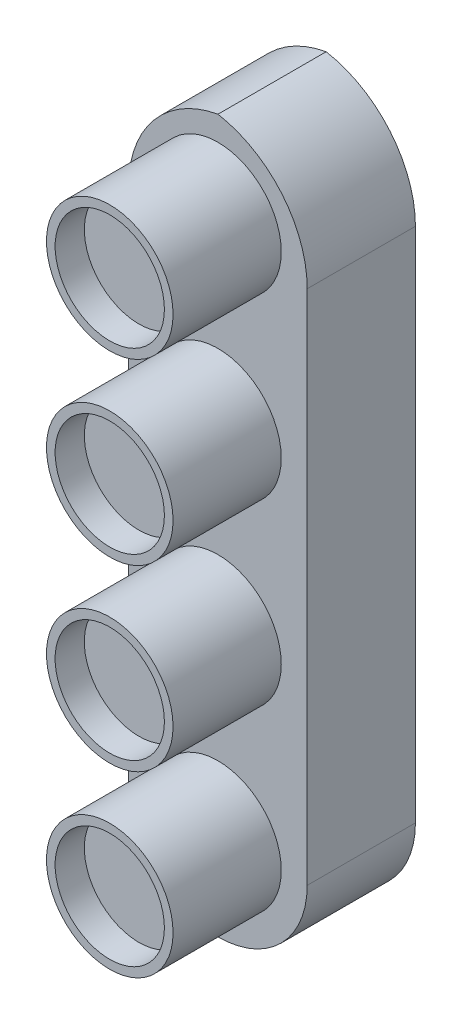
ISO-10303-21;
HEADER;
FILE_DESCRIPTION(('STEP AP214'),'2;1');
FILE_NAME('part.step','',(''),(''),'','','');
FILE_SCHEMA(('AUTOMOTIVE_DESIGN { 1 0 10303 214 1 1 1 1 }'));
ENDSEC;
DATA;
#1=APPLICATION_CONTEXT('core data for automotive mechanical design processes');
#2=APPLICATION_PROTOCOL_DEFINITION('international standard','automotive_design',2000,#1);
#3=PRODUCT_CONTEXT('',#1,'mechanical');
#4=PRODUCT('Part','Part','',(#3));
#5=PRODUCT_RELATED_PRODUCT_CATEGORY('part','',(#4));
#6=PRODUCT_DEFINITION_FORMATION('','',#4);
#7=PRODUCT_DEFINITION_CONTEXT('part definition',#1,'design');
#8=PRODUCT_DEFINITION('design','',#6,#7);
#9=PRODUCT_DEFINITION_SHAPE('','',#8);
#10=(LENGTH_UNIT() NAMED_UNIT(*) SI_UNIT(.MILLI.,.METRE.));
#11=(NAMED_UNIT(*) PLANE_ANGLE_UNIT() SI_UNIT($,.RADIAN.));
#12=(NAMED_UNIT(*) SI_UNIT($,.STERADIAN.) SOLID_ANGLE_UNIT());
#13=UNCERTAINTY_MEASURE_WITH_UNIT(LENGTH_MEASURE(1.E-05),#10,'distance_accuracy_value','');
#14=(GEOMETRIC_REPRESENTATION_CONTEXT(3) GLOBAL_UNCERTAINTY_ASSIGNED_CONTEXT((#13)) GLOBAL_UNIT_ASSIGNED_CONTEXT((#10,
#11,#12)) REPRESENTATION_CONTEXT('',''));
#15=CARTESIAN_POINT('',(0.,0.,0.));
#16=DIRECTION('',(0.,0.,1.));
#17=DIRECTION('',(1.,0.,0.));
#18=AXIS2_PLACEMENT_3D('',#15,#16,#17);
#19=CARTESIAN_POINT('',(-129.08402278584,165.,20.));
#20=DIRECTION('',(1.,0.,0.));
#21=DIRECTION('',(0.,1.,0.));
#22=AXIS2_PLACEMENT_3D('',#19,#20,#21);
#23=PLANE('',#22);
#24=DIRECTION('',(0.,-1.,0.));
#25=VECTOR('',#24,1.);
#26=CARTESIAN_POINT('',(-129.08402278584,165.,0.));
#27=LINE('',#26,#25);
#28=CARTESIAN_POINT('',(-129.08402278584,155.,0.));
#29=VERTEX_POINT('',#28);
#30=CARTESIAN_POINT('',(-129.08402278584,107.25,0.));
#31=VERTEX_POINT('',#30);
#32=EDGE_CURVE('E289',#29,#31,#27,.T.);
#33=ORIENTED_EDGE('',*,*,#32,.T.);
#34=DIRECTION('',(0.,0.,-1.));
#35=VECTOR('',#34,1.);
#36=CARTESIAN_POINT('',(-129.08402278584,107.25,20.));
#37=LINE('',#36,#35);
#38=CARTESIAN_POINT('',(-129.08402278584,107.25,10.));
#39=VERTEX_POINT('',#38);
#40=EDGE_CURVE('E341',#31,#39,#37,.F.);
#41=ORIENTED_EDGE('',*,*,#40,.T.);
#42=DIRECTION('',(0.,-1.,0.));
#43=VECTOR('',#42,1.);
#44=CARTESIAN_POINT('',(-129.08402278584,0.,10.));
#45=LINE('',#44,#43);
#46=CARTESIAN_POINT('',(-129.08402278584,155.,10.));
#47=VERTEX_POINT('',#46);
#48=EDGE_CURVE('E268',#47,#39,#45,.T.);
#49=ORIENTED_EDGE('',*,*,#48,.F.);
#50=DIRECTION('',(0.,0.,-1.));
#51=VECTOR('',#50,1.);
#52=CARTESIAN_POINT('',(-129.08402278584,155.,20.));
#53=LINE('',#52,#51);
#54=EDGE_CURVE('E310',#47,#29,#53,.T.);
#55=ORIENTED_EDGE('',*,*,#54,.T.);
#56=EDGE_LOOP('',(#33,#41,#49,#55));
#57=FACE_BOUND('',#56,.T.);
#58=ADVANCED_FACE('F99',(#57),#23,.F.);
#59=CARTESIAN_POINT('',(-112.58402278584,165.,20.));
#60=DIRECTION('',(-1.,0.,0.));
#61=DIRECTION('',(0.,-1.,0.));
#62=AXIS2_PLACEMENT_3D('',#59,#60,#61);
#63=PLANE('',#62);
#64=DIRECTION('',(0.,1.,0.));
#65=VECTOR('',#64,1.);
#66=CARTESIAN_POINT('',(-112.58402278584,0.,10.));
#67=LINE('',#66,#65);
#68=CARTESIAN_POINT('',(-112.58402278584,107.25,10.));
#69=VERTEX_POINT('',#68);
#70=CARTESIAN_POINT('',(-112.58402278584,155.,10.));
#71=VERTEX_POINT('',#70);
#72=EDGE_CURVE('E265',#69,#71,#67,.T.);
#73=ORIENTED_EDGE('',*,*,#72,.F.);
#74=DIRECTION('',(0.,0.,-1.));
#75=VECTOR('',#74,1.);
#76=CARTESIAN_POINT('',(-112.58402278584,107.25,20.));
#77=LINE('',#76,#75);
#78=CARTESIAN_POINT('',(-112.58402278584,107.25,0.));
#79=VERTEX_POINT('',#78);
#80=EDGE_CURVE('E350',#69,#79,#77,.T.);
#81=ORIENTED_EDGE('',*,*,#80,.T.);
#82=DIRECTION('',(0.,1.,0.));
#83=VECTOR('',#82,1.);
#84=CARTESIAN_POINT('',(-112.58402278584,165.,0.));
#85=LINE('',#84,#83);
#86=CARTESIAN_POINT('',(-112.58402278584,155.,0.));
#87=VERTEX_POINT('',#86);
#88=EDGE_CURVE('E307',#79,#87,#85,.T.);
#89=ORIENTED_EDGE('',*,*,#88,.T.);
#90=DIRECTION('',(0.,0.,-1.));
#91=VECTOR('',#90,1.);
#92=CARTESIAN_POINT('',(-112.58402278584,155.,20.));
#93=LINE('',#92,#91);
#94=EDGE_CURVE('E327',#87,#71,#93,.F.);
#95=ORIENTED_EDGE('',*,*,#94,.T.);
#96=EDGE_LOOP('',(#73,#81,#89,#95));
#97=FACE_BOUND('',#96,.T.);
#98=ADVANCED_FACE('F398',(#97),#63,.F.);
#99=CARTESIAN_POINT('',(0.,0.,0.));
#100=DIRECTION('',(0.,0.,1.));
#101=DIRECTION('',(1.,0.,0.));
#102=AXIS2_PLACEMENT_3D('',#99,#100,#101);
#103=PLANE('',#102);
#104=CARTESIAN_POINT('',(-120.83402278584,107.25,0.));
#105=DIRECTION('',(0.,0.,-1.));
#106=DIRECTION('',(-1.,0.,0.));
#107=AXIS2_PLACEMENT_3D('',#104,#105,#106);
#108=CIRCLE('',#107,6.25);
#109=CARTESIAN_POINT('',(-114.58402278584,107.25,0.));
#110=VERTEX_POINT('',#109);
#111=CARTESIAN_POINT('',(-127.08402278584,107.25,0.));
#112=VERTEX_POINT('',#111);
#113=EDGE_CURVE('E200',#110,#112,#108,.T.);
#114=ORIENTED_EDGE('',*,*,#113,.F.);
#115=DIRECTION('',(0.,-1.,0.));
#116=VECTOR('',#115,1.);
#117=CARTESIAN_POINT('',(-114.58402278584,155.,0.));
#118=LINE('',#117,#116);
#119=CARTESIAN_POINT('',(-114.58402278584,155.,0.));
#120=VERTEX_POINT('',#119);
#121=EDGE_CURVE('E115',#120,#110,#118,.T.);
#122=ORIENTED_EDGE('',*,*,#121,.F.);
#123=CARTESIAN_POINT('',(-122.58402278584,155.,0.));
#124=DIRECTION('',(0.,0.,-1.));
#125=DIRECTION('',(-1.,0.,0.));
#126=AXIS2_PLACEMENT_3D('',#123,#124,#125);
#127=CIRCLE('',#126,7.99999999999999);
#128=CARTESIAN_POINT('',(-120.83402278584,162.806247497998,0.));
#129=VERTEX_POINT('',#128);
#130=EDGE_CURVE('E229',#129,#120,#127,.T.);
#131=ORIENTED_EDGE('',*,*,#130,.F.);
#132=CARTESIAN_POINT('',(-119.08402278584,155.,0.));
#133=DIRECTION('',(0.,0.,-1.));
#134=DIRECTION('',(-1.,0.,0.));
#135=AXIS2_PLACEMENT_3D('',#132,#133,#134);
#136=CIRCLE('',#135,7.99999999999999);
#137=CARTESIAN_POINT('',(-127.08402278584,155.,0.));
#138=VERTEX_POINT('',#137);
#139=EDGE_CURVE('E225',#138,#129,#136,.T.);
#140=ORIENTED_EDGE('',*,*,#139,.F.);
#141=DIRECTION('',(0.,1.,0.));
#142=VECTOR('',#141,1.);
#143=CARTESIAN_POINT('',(-127.08402278584,107.25,0.));
#144=LINE('',#143,#142);
#145=EDGE_CURVE('E222',#112,#138,#144,.T.);
#146=ORIENTED_EDGE('',*,*,#145,.F.);
#147=EDGE_LOOP('',(#114,#122,#131,#140,#146));
#148=FACE_BOUND('',#147,.T.);
#149=CARTESIAN_POINT('',(-120.83402278584,107.25,0.));
#150=DIRECTION('',(0.,0.,1.));
#151=DIRECTION('',(1.,0.,0.));
#152=AXIS2_PLACEMENT_3D('',#149,#150,#151);
#153=CIRCLE('',#152,8.25);
#154=CARTESIAN_POINT('',(-120.83402278584,99.,0.));
#155=VERTEX_POINT('',#154);
#156=EDGE_CURVE('E331',#79,#155,#153,.F.);
#157=ORIENTED_EDGE('',*,*,#156,.T.);
#158=CARTESIAN_POINT('',(-120.83402278584,107.25,0.));
#159=DIRECTION('',(0.,0.,1.));
#160=DIRECTION('',(1.,0.,0.));
#161=AXIS2_PLACEMENT_3D('',#158,#159,#160);
#162=CIRCLE('',#161,8.25);
#163=EDGE_CURVE('E338',#155,#31,#162,.F.);
#164=ORIENTED_EDGE('',*,*,#163,.T.);
#165=ORIENTED_EDGE('',*,*,#32,.F.);
#166=CARTESIAN_POINT('',(-119.08402278584,155.,0.));
#167=DIRECTION('',(0.,0.,1.));
#168=DIRECTION('',(1.,0.,0.));
#169=AXIS2_PLACEMENT_3D('',#166,#167,#168);
#170=CIRCLE('',#169,10.);
#171=CARTESIAN_POINT('',(-120.83402278584,164.845684333758,0.));
#172=VERTEX_POINT('',#171);
#173=EDGE_CURVE('E318',#29,#172,#170,.F.);
#174=ORIENTED_EDGE('',*,*,#173,.T.);
#175=CARTESIAN_POINT('',(-122.58402278584,155.,0.));
#176=DIRECTION('',(0.,0.,1.));
#177=DIRECTION('',(1.,0.,0.));
#178=AXIS2_PLACEMENT_3D('',#175,#176,#177);
#179=CIRCLE('',#178,10.);
#180=EDGE_CURVE('E314',#172,#87,#179,.F.);
#181=ORIENTED_EDGE('',*,*,#180,.T.);
#182=ORIENTED_EDGE('',*,*,#88,.F.);
#183=EDGE_LOOP('',(#157,#164,#165,#174,#181,#182));
#184=FACE_BOUND('',#183,.T.);
#185=ADVANCED_FACE('F404',(#148,#184),#103,.F.);
#186=CARTESIAN_POINT('',(-120.83402278584,140.25,10.));
#187=DIRECTION('',(0.,0.,1.));
#188=DIRECTION('',(1.,0.,0.));
#189=AXIS2_PLACEMENT_3D('',#186,#187,#188);
#190=CYLINDRICAL_SURFACE('',#189,5.85);
#191=CARTESIAN_POINT('',(-120.83402278584,140.25,10.));
#192=DIRECTION('',(0.,0.,1.));
#193=DIRECTION('',(1.,0.,0.));
#194=AXIS2_PLACEMENT_3D('',#191,#192,#193);
#195=CIRCLE('',#194,5.85);
#196=CARTESIAN_POINT('',(-114.98402278584,140.25,10.));
#197=VERTEX_POINT('',#196);
#198=EDGE_CURVE('E281',#197,#197,#195,.T.);
#199=ORIENTED_EDGE('',*,*,#198,.T.);
#200=EDGE_LOOP('',(#199));
#201=FACE_BOUND('',#200,.T.);
#202=CARTESIAN_POINT('',(-120.83402278584,140.25,20.));
#203=DIRECTION('',(0.,0.,1.));
#204=DIRECTION('',(1.,0.,0.));
#205=AXIS2_PLACEMENT_3D('',#202,#203,#204);
#206=CIRCLE('',#205,5.85);
#207=CARTESIAN_POINT('',(-114.98402278584,140.25,20.));
#208=VERTEX_POINT('',#207);
#209=EDGE_CURVE('E297',#208,#208,#206,.T.);
#210=ORIENTED_EDGE('',*,*,#209,.F.);
#211=EDGE_LOOP('',(#210));
#212=FACE_BOUND('',#211,.T.);
#213=ADVANCED_FACE('F444',(#201,#212),#190,.T.);
#214=CARTESIAN_POINT('',(-120.83402278584,107.25,10.));
#215=DIRECTION('',(0.,0.,1.));
#216=DIRECTION('',(1.,0.,0.));
#217=AXIS2_PLACEMENT_3D('',#214,#215,#216);
#218=CYLINDRICAL_SURFACE('',#217,5.85);
#219=CARTESIAN_POINT('',(-120.83402278584,107.25,10.));
#220=DIRECTION('',(0.,0.,1.));
#221=DIRECTION('',(1.,0.,0.));
#222=AXIS2_PLACEMENT_3D('',#219,#220,#221);
#223=CIRCLE('',#222,5.85);
#224=CARTESIAN_POINT('',(-114.98402278584,107.25,10.));
#225=VERTEX_POINT('',#224);
#226=EDGE_CURVE('E277',#225,#225,#223,.F.);
#227=ORIENTED_EDGE('',*,*,#226,.F.);
#228=EDGE_LOOP('',(#227));
#229=FACE_BOUND('',#228,.T.);
#230=CARTESIAN_POINT('',(-120.83402278584,107.25,20.));
#231=DIRECTION('',(0.,0.,1.));
#232=DIRECTION('',(1.,0.,0.));
#233=AXIS2_PLACEMENT_3D('',#230,#231,#232);
#234=CIRCLE('',#233,5.85);
#235=CARTESIAN_POINT('',(-114.98402278584,107.25,20.));
#236=VERTEX_POINT('',#235);
#237=EDGE_CURVE('E293',#236,#236,#234,.F.);
#238=ORIENTED_EDGE('',*,*,#237,.T.);
#239=EDGE_LOOP('',(#238));
#240=FACE_BOUND('',#239,.T.);
#241=ADVANCED_FACE('F449',(#229,#240),#218,.T.);
#242=CARTESIAN_POINT('',(-120.83402278584,123.75,10.));
#243=DIRECTION('',(0.,0.,1.));
#244=DIRECTION('',(1.,0.,0.));
#245=AXIS2_PLACEMENT_3D('',#242,#243,#244);
#246=CYLINDRICAL_SURFACE('',#245,5.85);
#247=CARTESIAN_POINT('',(-120.83402278584,123.75,10.));
#248=DIRECTION('',(0.,0.,1.));
#249=DIRECTION('',(1.,0.,0.));
#250=AXIS2_PLACEMENT_3D('',#247,#248,#249);
#251=CIRCLE('',#250,5.85);
#252=CARTESIAN_POINT('',(-114.98402278584,123.75,10.));
#253=VERTEX_POINT('',#252);
#254=EDGE_CURVE('E273',#253,#253,#251,.F.);
#255=ORIENTED_EDGE('',*,*,#254,.F.);
#256=EDGE_LOOP('',(#255));
#257=FACE_BOUND('',#256,.T.);
#258=CARTESIAN_POINT('',(-120.83402278584,123.75,20.));
#259=DIRECTION('',(0.,0.,1.));
#260=DIRECTION('',(1.,0.,0.));
#261=AXIS2_PLACEMENT_3D('',#258,#259,#260);
#262=CIRCLE('',#261,5.85);
#263=CARTESIAN_POINT('',(-114.98402278584,123.75,20.));
#264=VERTEX_POINT('',#263);
#265=EDGE_CURVE('E261',#264,#264,#262,.F.);
#266=ORIENTED_EDGE('',*,*,#265,.T.);
#267=EDGE_LOOP('',(#266));
#268=FACE_BOUND('',#267,.T.);
#269=ADVANCED_FACE('F493',(#257,#268),#246,.T.);
#270=CARTESIAN_POINT('',(-120.83402278584,156.75,10.));
#271=DIRECTION('',(0.,0.,1.));
#272=DIRECTION('',(1.,0.,0.));
#273=AXIS2_PLACEMENT_3D('',#270,#271,#272);
#274=CYLINDRICAL_SURFACE('',#273,5.85);
#275=CARTESIAN_POINT('',(-120.83402278584,156.75,10.));
#276=DIRECTION('',(0.,0.,1.));
#277=DIRECTION('',(1.,0.,0.));
#278=AXIS2_PLACEMENT_3D('',#275,#276,#277);
#279=CIRCLE('',#278,5.85);
#280=CARTESIAN_POINT('',(-114.98402278584,156.75,10.));
#281=VERTEX_POINT('',#280);
#282=EDGE_CURVE('E285',#281,#281,#279,.T.);
#283=ORIENTED_EDGE('',*,*,#282,.T.);
#284=EDGE_LOOP('',(#283));
#285=FACE_BOUND('',#284,.T.);
#286=CARTESIAN_POINT('',(-120.83402278584,156.75,20.));
#287=DIRECTION('',(0.,0.,1.));
#288=DIRECTION('',(1.,0.,0.));
#289=AXIS2_PLACEMENT_3D('',#286,#287,#288);
#290=CIRCLE('',#289,5.85);
#291=CARTESIAN_POINT('',(-114.98402278584,156.75,20.));
#292=VERTEX_POINT('',#291);
#293=EDGE_CURVE('E269',#292,#292,#290,.T.);
#294=ORIENTED_EDGE('',*,*,#293,.F.);
#295=EDGE_LOOP('',(#294));
#296=FACE_BOUND('',#295,.T.);
#297=ADVANCED_FACE('F389',(#285,#296),#274,.T.);
#298=CARTESIAN_POINT('',(0.,0.,10.));
#299=DIRECTION('',(0.,0.,1.));
#300=DIRECTION('',(1.,0.,0.));
#301=AXIS2_PLACEMENT_3D('',#298,#299,#300);
#302=PLANE('',#301);
#303=ORIENTED_EDGE('',*,*,#48,.T.);
#304=CARTESIAN_POINT('',(-120.83402278584,107.25,10.));
#305=DIRECTION('',(0.,0.,1.));
#306=DIRECTION('',(1.,0.,0.));
#307=AXIS2_PLACEMENT_3D('',#304,#305,#306);
#308=CIRCLE('',#307,8.25);
#309=CARTESIAN_POINT('',(-120.83402278584,99.,10.));
#310=VERTEX_POINT('',#309);
#311=EDGE_CURVE('E347',#39,#310,#308,.T.);
#312=ORIENTED_EDGE('',*,*,#311,.T.);
#313=CARTESIAN_POINT('',(-120.83402278584,107.25,10.));
#314=DIRECTION('',(0.,0.,1.));
#315=DIRECTION('',(1.,0.,0.));
#316=AXIS2_PLACEMENT_3D('',#313,#314,#315);
#317=CIRCLE('',#316,8.25);
#318=EDGE_CURVE('E123',#310,#69,#317,.T.);
#319=ORIENTED_EDGE('',*,*,#318,.T.);
#320=ORIENTED_EDGE('',*,*,#72,.T.);
#321=CARTESIAN_POINT('',(-122.58402278584,155.,10.));
#322=DIRECTION('',(0.,0.,1.));
#323=DIRECTION('',(1.,0.,0.));
#324=AXIS2_PLACEMENT_3D('',#321,#322,#323);
#325=CIRCLE('',#324,10.);
#326=CARTESIAN_POINT('',(-120.83402278584,164.845684333758,10.));
#327=VERTEX_POINT('',#326);
#328=EDGE_CURVE('E321',#71,#327,#325,.T.);
#329=ORIENTED_EDGE('',*,*,#328,.T.);
#330=CARTESIAN_POINT('',(-119.08402278584,155.,10.));
#331=DIRECTION('',(0.,0.,1.));
#332=DIRECTION('',(1.,0.,0.));
#333=AXIS2_PLACEMENT_3D('',#330,#331,#332);
#334=CIRCLE('',#333,10.);
#335=EDGE_CURVE('E324',#327,#47,#334,.T.);
#336=ORIENTED_EDGE('',*,*,#335,.T.);
#337=EDGE_LOOP('',(#303,#312,#319,#320,#329,#336));
#338=FACE_BOUND('',#337,.T.);
#339=ORIENTED_EDGE('',*,*,#254,.T.);
#340=EDGE_LOOP('',(#339));
#341=FACE_BOUND('',#340,.T.);
#342=ORIENTED_EDGE('',*,*,#226,.T.);
#343=EDGE_LOOP('',(#342));
#344=FACE_BOUND('',#343,.T.);
#345=ORIENTED_EDGE('',*,*,#198,.F.);
#346=EDGE_LOOP('',(#345));
#347=FACE_BOUND('',#346,.T.);
#348=ORIENTED_EDGE('',*,*,#282,.F.);
#349=EDGE_LOOP('',(#348));
#350=FACE_BOUND('',#349,.T.);
#351=ADVANCED_FACE('F379',(#338,#341,#344,#347,#350),#302,.T.);
#352=CARTESIAN_POINT('',(0.,0.,20.));
#353=DIRECTION('',(0.,0.,1.));
#354=DIRECTION('',(1.,0.,0.));
#355=AXIS2_PLACEMENT_3D('',#352,#353,#354);
#356=PLANE('',#355);
#357=ORIENTED_EDGE('',*,*,#265,.F.);
#358=EDGE_LOOP('',(#357));
#359=FACE_BOUND('',#358,.T.);
#360=CARTESIAN_POINT('',(-120.83402278584,123.75,20.));
#361=DIRECTION('',(0.,0.,1.));
#362=DIRECTION('',(1.,0.,0.));
#363=AXIS2_PLACEMENT_3D('',#360,#361,#362);
#364=CIRCLE('',#363,5.05);
#365=CARTESIAN_POINT('',(-115.78402278584,123.75,20.));
#366=VERTEX_POINT('',#365);
#367=EDGE_CURVE('E251',#366,#366,#364,.F.);
#368=ORIENTED_EDGE('',*,*,#367,.T.);
#369=EDGE_LOOP('',(#368));
#370=FACE_BOUND('',#369,.T.);
#371=ADVANCED_FACE('F376',(#359,#370),#356,.T.);
#372=ORIENTED_EDGE('',*,*,#237,.F.);
#373=EDGE_LOOP('',(#372));
#374=FACE_BOUND('',#373,.T.);
#375=CARTESIAN_POINT('',(-120.83402278584,107.25,20.));
#376=DIRECTION('',(0.,0.,1.));
#377=DIRECTION('',(1.,0.,0.));
#378=AXIS2_PLACEMENT_3D('',#375,#376,#377);
#379=CIRCLE('',#378,5.05);
#380=CARTESIAN_POINT('',(-115.78402278584,107.25,20.));
#381=VERTEX_POINT('',#380);
#382=EDGE_CURVE('E247',#381,#381,#379,.F.);
#383=ORIENTED_EDGE('',*,*,#382,.T.);
#384=EDGE_LOOP('',(#383));
#385=FACE_BOUND('',#384,.T.);
#386=ADVANCED_FACE('F378',(#374,#385),#356,.T.);
#387=CARTESIAN_POINT('',(-120.83402278584,140.25,20.));
#388=DIRECTION('',(0.,0.,1.));
#389=DIRECTION('',(1.,0.,0.));
#390=AXIS2_PLACEMENT_3D('',#387,#388,#389);
#391=CIRCLE('',#390,5.05);
#392=CARTESIAN_POINT('',(-115.78402278584,140.25,20.));
#393=VERTEX_POINT('',#392);
#394=EDGE_CURVE('E257',#393,#393,#391,.T.);
#395=ORIENTED_EDGE('',*,*,#394,.F.);
#396=EDGE_LOOP('',(#395));
#397=FACE_BOUND('',#396,.T.);
#398=ORIENTED_EDGE('',*,*,#209,.T.);
#399=EDGE_LOOP('',(#398));
#400=FACE_BOUND('',#399,.T.);
#401=ADVANCED_FACE('F387',(#397,#400),#356,.T.);
#402=CARTESIAN_POINT('',(-120.83402278584,107.25,10.));
#403=DIRECTION('',(0.,0.,1.));
#404=DIRECTION('',(1.,0.,0.));
#405=AXIS2_PLACEMENT_3D('',#402,#403,#404);
#406=CYLINDRICAL_SURFACE('',#405,5.05);
#407=CARTESIAN_POINT('',(-120.83402278584,107.25,17.3));
#408=DIRECTION('',(0.,0.,1.));
#409=DIRECTION('',(1.,0.,0.));
#410=AXIS2_PLACEMENT_3D('',#407,#408,#409);
#411=CIRCLE('',#410,5.05);
#412=CARTESIAN_POINT('',(-115.78402278584,107.25,17.3));
#413=VERTEX_POINT('',#412);
#414=EDGE_CURVE('E12',#413,#413,#411,.T.);
#415=ORIENTED_EDGE('',*,*,#414,.F.);
#416=EDGE_LOOP('',(#415));
#417=FACE_BOUND('',#416,.T.);
#418=ORIENTED_EDGE('',*,*,#382,.F.);
#419=EDGE_LOOP('',(#418));
#420=FACE_BOUND('',#419,.T.);
#421=ADVANCED_FACE('F372',(#417,#420),#406,.F.);
#422=CARTESIAN_POINT('',(-120.83402278584,123.75,10.));
#423=DIRECTION('',(0.,0.,1.));
#424=DIRECTION('',(1.,0.,0.));
#425=AXIS2_PLACEMENT_3D('',#422,#423,#424);
#426=CYLINDRICAL_SURFACE('',#425,5.05);
#427=CARTESIAN_POINT('',(-120.83402278584,123.75,17.3));
#428=DIRECTION('',(0.,0.,1.));
#429=DIRECTION('',(1.,0.,0.));
#430=AXIS2_PLACEMENT_3D('',#427,#428,#429);
#431=CIRCLE('',#430,5.05);
#432=CARTESIAN_POINT('',(-115.78402278584,123.75,17.3));
#433=VERTEX_POINT('',#432);
#434=EDGE_CURVE('E108',#433,#433,#431,.T.);
#435=ORIENTED_EDGE('',*,*,#434,.F.);
#436=EDGE_LOOP('',(#435));
#437=FACE_BOUND('',#436,.T.);
#438=ORIENTED_EDGE('',*,*,#367,.F.);
#439=EDGE_LOOP('',(#438));
#440=FACE_BOUND('',#439,.T.);
#441=ADVANCED_FACE('F368',(#437,#440),#426,.F.);
#442=CARTESIAN_POINT('',(-120.83402278584,140.25,10.));
#443=DIRECTION('',(0.,0.,1.));
#444=DIRECTION('',(1.,0.,0.));
#445=AXIS2_PLACEMENT_3D('',#442,#443,#444);
#446=CYLINDRICAL_SURFACE('',#445,5.05);
#447=CARTESIAN_POINT('',(-120.83402278584,140.25,17.3));
#448=DIRECTION('',(0.,0.,1.));
#449=DIRECTION('',(1.,0.,0.));
#450=AXIS2_PLACEMENT_3D('',#447,#448,#449);
#451=CIRCLE('',#450,5.05);
#452=CARTESIAN_POINT('',(-115.78402278584,140.25,17.3));
#453=VERTEX_POINT('',#452);
#454=EDGE_CURVE('E238',#453,#453,#451,.F.);
#455=ORIENTED_EDGE('',*,*,#454,.T.);
#456=EDGE_LOOP('',(#455));
#457=FACE_BOUND('',#456,.T.);
#458=ORIENTED_EDGE('',*,*,#394,.T.);
#459=EDGE_LOOP('',(#458));
#460=FACE_BOUND('',#459,.T.);
#461=ADVANCED_FACE('F371',(#457,#460),#446,.F.);
#462=CARTESIAN_POINT('',(-120.83402278584,156.75,20.));
#463=DIRECTION('',(0.,0.,1.));
#464=DIRECTION('',(1.,0.,0.));
#465=AXIS2_PLACEMENT_3D('',#462,#463,#464);
#466=CIRCLE('',#465,5.05);
#467=CARTESIAN_POINT('',(-115.78402278584,156.75,20.));
#468=VERTEX_POINT('',#467);
#469=EDGE_CURVE('E252',#468,#468,#466,.T.);
#470=ORIENTED_EDGE('',*,*,#469,.F.);
#471=EDGE_LOOP('',(#470));
#472=FACE_BOUND('',#471,.T.);
#473=ORIENTED_EDGE('',*,*,#293,.T.);
#474=EDGE_LOOP('',(#473));
#475=FACE_BOUND('',#474,.T.);
#476=ADVANCED_FACE('F382',(#472,#475),#356,.T.);
#477=CARTESIAN_POINT('',(-120.83402278584,156.75,10.));
#478=DIRECTION('',(0.,0.,1.));
#479=DIRECTION('',(1.,0.,0.));
#480=AXIS2_PLACEMENT_3D('',#477,#478,#479);
#481=CYLINDRICAL_SURFACE('',#480,5.05);
#482=CARTESIAN_POINT('',(-120.83402278584,156.75,17.3));
#483=DIRECTION('',(0.,0.,1.));
#484=DIRECTION('',(1.,0.,0.));
#485=AXIS2_PLACEMENT_3D('',#482,#483,#484);
#486=CIRCLE('',#485,5.05);
#487=CARTESIAN_POINT('',(-115.78402278584,156.75,17.3));
#488=VERTEX_POINT('',#487);
#489=EDGE_CURVE('E356',#488,#488,#486,.F.);
#490=ORIENTED_EDGE('',*,*,#489,.T.);
#491=EDGE_LOOP('',(#490));
#492=FACE_BOUND('',#491,.T.);
#493=ORIENTED_EDGE('',*,*,#469,.T.);
#494=EDGE_LOOP('',(#493));
#495=FACE_BOUND('',#494,.T.);
#496=ADVANCED_FACE('F395',(#492,#495),#481,.F.);
#497=CARTESIAN_POINT('',(-122.58402278584,155.,20.));
#498=DIRECTION('',(0.,0.,-1.));
#499=DIRECTION('',(-1.,0.,0.));
#500=AXIS2_PLACEMENT_3D('',#497,#498,#499);
#501=CYLINDRICAL_SURFACE('',#500,10.);
#502=DIRECTION('',(0.,0.,-1.));
#503=VECTOR('',#502,1.);
#504=CARTESIAN_POINT('',(-120.83402278584,164.845684333758,5.));
#505=LINE('',#504,#503);
#506=EDGE_CURVE('E256',#327,#172,#505,.T.);
#507=ORIENTED_EDGE('',*,*,#506,.F.);
#508=ORIENTED_EDGE('',*,*,#328,.F.);
#509=ORIENTED_EDGE('',*,*,#94,.F.);
#510=ORIENTED_EDGE('',*,*,#180,.F.);
#511=EDGE_LOOP('',(#507,#508,#509,#510));
#512=FACE_BOUND('',#511,.T.);
#513=ADVANCED_FACE('F411',(#512),#501,.T.);
#514=CARTESIAN_POINT('',(-119.08402278584,155.,20.));
#515=DIRECTION('',(0.,0.,-1.));
#516=DIRECTION('',(-1.,0.,0.));
#517=AXIS2_PLACEMENT_3D('',#514,#515,#516);
#518=CYLINDRICAL_SURFACE('',#517,10.);
#519=ORIENTED_EDGE('',*,*,#335,.F.);
#520=ORIENTED_EDGE('',*,*,#506,.T.);
#521=ORIENTED_EDGE('',*,*,#173,.F.);
#522=ORIENTED_EDGE('',*,*,#54,.F.);
#523=EDGE_LOOP('',(#519,#520,#521,#522));
#524=FACE_BOUND('',#523,.T.);
#525=ADVANCED_FACE('F408',(#524),#518,.T.);
#526=CARTESIAN_POINT('',(-120.83402278584,107.25,20.));
#527=DIRECTION('',(0.,0.,-1.));
#528=DIRECTION('',(-1.,0.,0.));
#529=AXIS2_PLACEMENT_3D('',#526,#527,#528);
#530=CYLINDRICAL_SURFACE('',#529,8.25);
#531=ORIENTED_EDGE('',*,*,#80,.F.);
#532=ORIENTED_EDGE('',*,*,#318,.F.);
#533=DIRECTION('',(0.,0.,-1.));
#534=VECTOR('',#533,1.);
#535=CARTESIAN_POINT('',(-120.83402278584,99.,20.));
#536=LINE('',#535,#534);
#537=EDGE_CURVE('E335',#155,#310,#536,.F.);
#538=ORIENTED_EDGE('',*,*,#537,.F.);
#539=ORIENTED_EDGE('',*,*,#156,.F.);
#540=EDGE_LOOP('',(#531,#532,#538,#539));
#541=FACE_BOUND('',#540,.T.);
#542=ADVANCED_FACE('F101',(#541),#530,.T.);
#543=CARTESIAN_POINT('',(-120.83402278584,107.25,20.));
#544=DIRECTION('',(0.,0.,-1.));
#545=DIRECTION('',(-1.,0.,0.));
#546=AXIS2_PLACEMENT_3D('',#543,#544,#545);
#547=CYLINDRICAL_SURFACE('',#546,8.25);
#548=ORIENTED_EDGE('',*,*,#311,.F.);
#549=ORIENTED_EDGE('',*,*,#40,.F.);
#550=ORIENTED_EDGE('',*,*,#163,.F.);
#551=ORIENTED_EDGE('',*,*,#537,.T.);
#552=EDGE_LOOP('',(#548,#549,#550,#551));
#553=FACE_BOUND('',#552,.T.);
#554=ADVANCED_FACE('F415',(#553),#547,.T.);
#555=CARTESIAN_POINT('',(-120.83402278584,156.75,17.3));
#556=DIRECTION('',(0.,0.,1.));
#557=DIRECTION('',(1.,0.,0.));
#558=AXIS2_PLACEMENT_3D('',#555,#556,#557);
#559=PLANE('',#558);
#560=ORIENTED_EDGE('',*,*,#489,.F.);
#561=EDGE_LOOP('',(#560));
#562=FACE_BOUND('',#561,.T.);
#563=ADVANCED_FACE('F417',(#562),#559,.T.);
#564=CARTESIAN_POINT('',(-120.83402278584,140.25,17.3));
#565=DIRECTION('',(0.,0.,1.));
#566=DIRECTION('',(1.,0.,0.));
#567=AXIS2_PLACEMENT_3D('',#564,#565,#566);
#568=PLANE('',#567);
#569=ORIENTED_EDGE('',*,*,#454,.F.);
#570=EDGE_LOOP('',(#569));
#571=FACE_BOUND('',#570,.T.);
#572=ADVANCED_FACE('F423',(#571),#568,.T.);
#573=CARTESIAN_POINT('',(-120.83402278584,123.75,17.3));
#574=DIRECTION('',(0.,0.,1.));
#575=DIRECTION('',(1.,0.,0.));
#576=AXIS2_PLACEMENT_3D('',#573,#574,#575);
#577=PLANE('',#576);
#578=ORIENTED_EDGE('',*,*,#434,.T.);
#579=EDGE_LOOP('',(#578));
#580=FACE_BOUND('',#579,.T.);
#581=ADVANCED_FACE('F366',(#580),#577,.T.);
#582=CARTESIAN_POINT('',(-120.83402278584,107.25,17.3));
#583=DIRECTION('',(0.,0.,1.));
#584=DIRECTION('',(1.,0.,0.));
#585=AXIS2_PLACEMENT_3D('',#582,#583,#584);
#586=PLANE('',#585);
#587=ORIENTED_EDGE('',*,*,#414,.T.);
#588=EDGE_LOOP('',(#587));
#589=FACE_BOUND('',#588,.T.);
#590=ADVANCED_FACE('F467',(#589),#586,.T.);
#591=CARTESIAN_POINT('',(-114.58402278584,155.,9.));
#592=DIRECTION('',(1.,0.,0.));
#593=DIRECTION('',(0.,1.,0.));
#594=AXIS2_PLACEMENT_3D('',#591,#592,#593);
#595=PLANE('',#594);
#596=ORIENTED_EDGE('',*,*,#121,.T.);
#597=DIRECTION('',(0.,0.,-1.));
#598=VECTOR('',#597,1.);
#599=CARTESIAN_POINT('',(-114.58402278584,107.25,9.));
#600=LINE('',#599,#598);
#601=CARTESIAN_POINT('',(-114.58402278584,107.25,9.));
#602=VERTEX_POINT('',#601);
#603=EDGE_CURVE('E235',#602,#110,#600,.T.);
#604=ORIENTED_EDGE('',*,*,#603,.F.);
#605=DIRECTION('',(0.,-1.,0.));
#606=VECTOR('',#605,1.);
#607=CARTESIAN_POINT('',(-114.58402278584,155.,9.));
#608=LINE('',#607,#606);
#609=CARTESIAN_POINT('',(-114.58402278584,155.,9.));
#610=VERTEX_POINT('',#609);
#611=EDGE_CURVE('E192',#610,#602,#608,.T.);
#612=ORIENTED_EDGE('',*,*,#611,.F.);
#613=DIRECTION('',(0.,0.,-1.));
#614=VECTOR('',#613,1.);
#615=CARTESIAN_POINT('',(-114.58402278584,155.,9.));
#616=LINE('',#615,#614);
#617=EDGE_CURVE('E239',#610,#120,#616,.T.);
#618=ORIENTED_EDGE('',*,*,#617,.T.);
#619=EDGE_LOOP('',(#596,#604,#612,#618));
#620=FACE_BOUND('',#619,.T.);
#621=ADVANCED_FACE('F458',(#620),#595,.F.);
#622=CARTESIAN_POINT('',(-122.58402278584,155.,9.));
#623=DIRECTION('',(0.,0.,-1.));
#624=DIRECTION('',(-1.,0.,0.));
#625=AXIS2_PLACEMENT_3D('',#622,#623,#624);
#626=CYLINDRICAL_SURFACE('',#625,7.99999999999999);
#627=ORIENTED_EDGE('',*,*,#130,.T.);
#628=ORIENTED_EDGE('',*,*,#617,.F.);
#629=CARTESIAN_POINT('',(-122.58402278584,155.,9.));
#630=DIRECTION('',(0.,0.,-1.));
#631=DIRECTION('',(-1.,0.,0.));
#632=AXIS2_PLACEMENT_3D('',#629,#630,#631);
#633=CIRCLE('',#632,7.99999999999999);
#634=CARTESIAN_POINT('',(-120.83402278584,162.806247497998,9.));
#635=VERTEX_POINT('',#634);
#636=EDGE_CURVE('E213',#635,#610,#633,.T.);
#637=ORIENTED_EDGE('',*,*,#636,.F.);
#638=DIRECTION('',(0.,0.,-1.));
#639=VECTOR('',#638,1.);
#640=CARTESIAN_POINT('',(-120.83402278584,162.806247497998,9.));
#641=LINE('',#640,#639);
#642=EDGE_CURVE('E242',#635,#129,#641,.T.);
#643=ORIENTED_EDGE('',*,*,#642,.T.);
#644=EDGE_LOOP('',(#627,#628,#637,#643));
#645=FACE_BOUND('',#644,.T.);
#646=ADVANCED_FACE('F459',(#645),#626,.F.);
#647=CARTESIAN_POINT('',(-119.08402278584,155.,9.));
#648=DIRECTION('',(0.,0.,-1.));
#649=DIRECTION('',(-1.,0.,0.));
#650=AXIS2_PLACEMENT_3D('',#647,#648,#649);
#651=CYLINDRICAL_SURFACE('',#650,7.99999999999999);
#652=ORIENTED_EDGE('',*,*,#139,.T.);
#653=ORIENTED_EDGE('',*,*,#642,.F.);
#654=CARTESIAN_POINT('',(-119.08402278584,155.,9.));
#655=DIRECTION('',(0.,0.,-1.));
#656=DIRECTION('',(-1.,0.,0.));
#657=AXIS2_PLACEMENT_3D('',#654,#655,#656);
#658=CIRCLE('',#657,7.99999999999999);
#659=CARTESIAN_POINT('',(-127.08402278584,155.,9.));
#660=VERTEX_POINT('',#659);
#661=EDGE_CURVE('E210',#660,#635,#658,.T.);
#662=ORIENTED_EDGE('',*,*,#661,.F.);
#663=DIRECTION('',(0.,0.,-1.));
#664=VECTOR('',#663,1.);
#665=CARTESIAN_POINT('',(-127.08402278584,155.,9.));
#666=LINE('',#665,#664);
#667=EDGE_CURVE('E205',#660,#138,#666,.T.);
#668=ORIENTED_EDGE('',*,*,#667,.T.);
#669=EDGE_LOOP('',(#652,#653,#662,#668));
#670=FACE_BOUND('',#669,.T.);
#671=ADVANCED_FACE('F455',(#670),#651,.F.);
#672=CARTESIAN_POINT('',(-127.08402278584,107.25,9.));
#673=DIRECTION('',(-1.,0.,0.));
#674=DIRECTION('',(0.,-1.,0.));
#675=AXIS2_PLACEMENT_3D('',#672,#673,#674);
#676=PLANE('',#675);
#677=ORIENTED_EDGE('',*,*,#145,.T.);
#678=ORIENTED_EDGE('',*,*,#667,.F.);
#679=DIRECTION('',(0.,1.,0.));
#680=VECTOR('',#679,1.);
#681=CARTESIAN_POINT('',(-127.08402278584,107.25,9.));
#682=LINE('',#681,#680);
#683=CARTESIAN_POINT('',(-127.08402278584,107.25,9.));
#684=VERTEX_POINT('',#683);
#685=EDGE_CURVE('E189',#684,#660,#682,.T.);
#686=ORIENTED_EDGE('',*,*,#685,.F.);
#687=DIRECTION('',(0.,0.,-1.));
#688=VECTOR('',#687,1.);
#689=CARTESIAN_POINT('',(-127.08402278584,107.25,9.));
#690=LINE('',#689,#688);
#691=EDGE_CURVE('E197',#684,#112,#690,.T.);
#692=ORIENTED_EDGE('',*,*,#691,.T.);
#693=EDGE_LOOP('',(#677,#678,#686,#692));
#694=FACE_BOUND('',#693,.T.);
#695=ADVANCED_FACE('F207',(#694),#676,.F.);
#696=CARTESIAN_POINT('',(-120.83402278584,107.25,9.));
#697=DIRECTION('',(0.,0.,-1.));
#698=DIRECTION('',(-1.,0.,0.));
#699=AXIS2_PLACEMENT_3D('',#696,#697,#698);
#700=CYLINDRICAL_SURFACE('',#699,6.25);
#701=ORIENTED_EDGE('',*,*,#113,.T.);
#702=ORIENTED_EDGE('',*,*,#691,.F.);
#703=CARTESIAN_POINT('',(-120.83402278584,107.25,9.));
#704=DIRECTION('',(0.,0.,-1.));
#705=DIRECTION('',(-1.,0.,0.));
#706=AXIS2_PLACEMENT_3D('',#703,#704,#705);
#707=CIRCLE('',#706,6.24999999999999);
#708=EDGE_CURVE('E184',#602,#684,#707,.T.);
#709=ORIENTED_EDGE('',*,*,#708,.F.);
#710=ORIENTED_EDGE('',*,*,#603,.T.);
#711=EDGE_LOOP('',(#701,#702,#709,#710));
#712=FACE_BOUND('',#711,.T.);
#713=ADVANCED_FACE('F198',(#712),#700,.F.);
#714=CARTESIAN_POINT('',(-120.83402278584,107.25,9.));
#715=DIRECTION('',(0.,0.,-1.));
#716=DIRECTION('',(-1.,0.,0.));
#717=AXIS2_PLACEMENT_3D('',#714,#715,#716);
#718=PLANE('',#717);
#719=ORIENTED_EDGE('',*,*,#708,.T.);
#720=ORIENTED_EDGE('',*,*,#685,.T.);
#721=ORIENTED_EDGE('',*,*,#661,.T.);
#722=ORIENTED_EDGE('',*,*,#636,.T.);
#723=ORIENTED_EDGE('',*,*,#611,.T.);
#724=EDGE_LOOP('',(#719,#720,#721,#722,#723));
#725=FACE_BOUND('',#724,.T.);
#726=ADVANCED_FACE('F186',(#725),#718,.T.);
#727=CLOSED_SHELL('',(#58,#98,#185,#213,#241,#269,#297,#351,#371,#386,#401,#421,#441,#461,#476,
#496,#513,#525,#542,#554,#563,#572,#581,#590,#621,#646,#671,#695,#713,#726));
#728=MANIFOLD_SOLID_BREP('B2',#727);
#729=ADVANCED_BREP_SHAPE_REPRESENTATION('',(#18,#728),#14);
#730=SHAPE_DEFINITION_REPRESENTATION(#9,#729);
ENDSEC;
END-ISO-10303-21;
